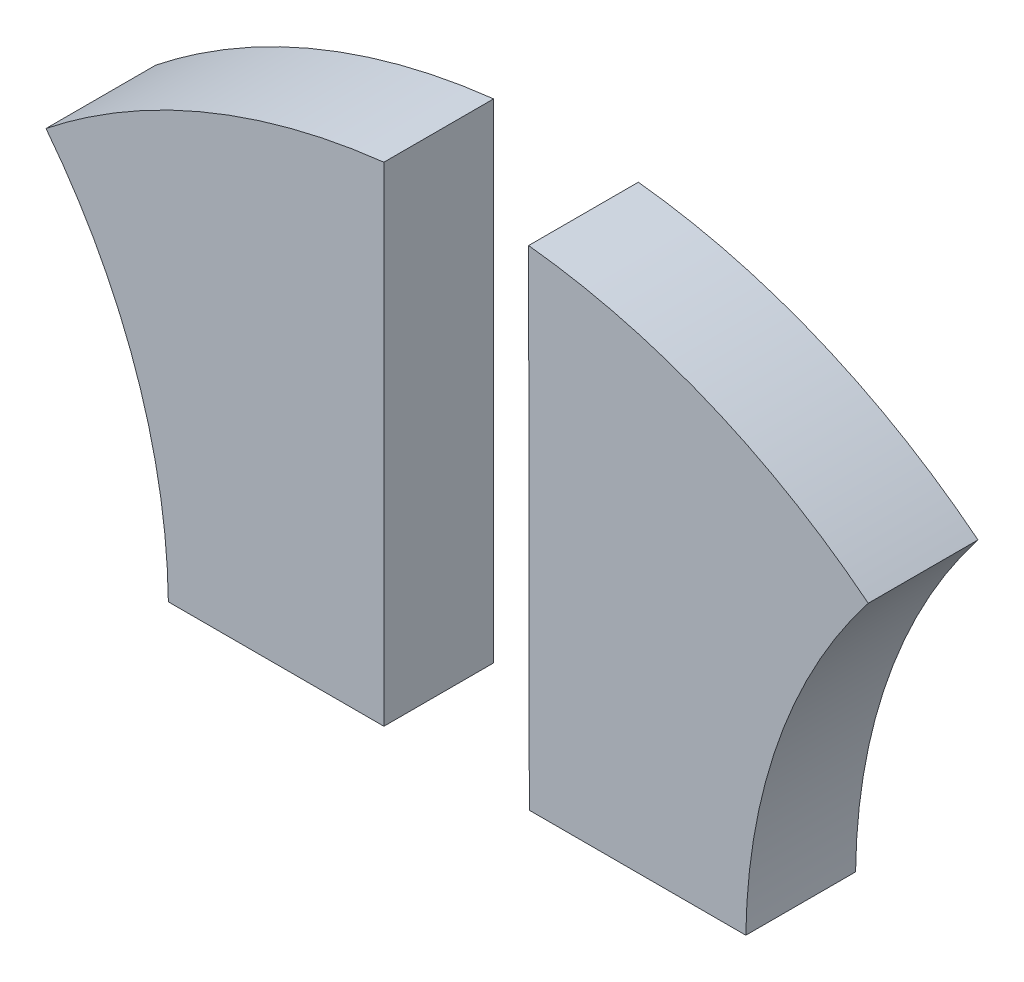
ISO-10303-21;
HEADER;
FILE_DESCRIPTION(('STEP AP214'),'2;1');
FILE_NAME('part.step','',(''),(''),'','','');
FILE_SCHEMA(('AUTOMOTIVE_DESIGN { 1 0 10303 214 1 1 1 1 }'));
ENDSEC;
DATA;
#1=APPLICATION_CONTEXT('core data for automotive mechanical design processes');
#2=APPLICATION_PROTOCOL_DEFINITION('international standard','automotive_design',2000,#1);
#3=PRODUCT_CONTEXT('',#1,'mechanical');
#4=PRODUCT('Part','Part','',(#3));
#5=PRODUCT_RELATED_PRODUCT_CATEGORY('part','',(#4));
#6=PRODUCT_DEFINITION_FORMATION('','',#4);
#7=PRODUCT_DEFINITION_CONTEXT('part definition',#1,'design');
#8=PRODUCT_DEFINITION('design','',#6,#7);
#9=PRODUCT_DEFINITION_SHAPE('','',#8);
#10=(LENGTH_UNIT() NAMED_UNIT(*) SI_UNIT(.MILLI.,.METRE.));
#11=(NAMED_UNIT(*) PLANE_ANGLE_UNIT() SI_UNIT($,.RADIAN.));
#12=(NAMED_UNIT(*) SI_UNIT($,.STERADIAN.) SOLID_ANGLE_UNIT());
#13=UNCERTAINTY_MEASURE_WITH_UNIT(LENGTH_MEASURE(1.E-05),#10,'distance_accuracy_value','');
#14=(GEOMETRIC_REPRESENTATION_CONTEXT(3) GLOBAL_UNCERTAINTY_ASSIGNED_CONTEXT((#13)) GLOBAL_UNIT_ASSIGNED_CONTEXT((#10,
#11,#12)) REPRESENTATION_CONTEXT('',''));
#15=CARTESIAN_POINT('',(0.,0.,0.));
#16=DIRECTION('',(0.,0.,1.));
#17=DIRECTION('',(1.,0.,0.));
#18=AXIS2_PLACEMENT_3D('',#15,#16,#17);
#19=CARTESIAN_POINT('',(60.095572165397,10.8267054054504,3.));
#20=DIRECTION('',(0.,0.,-1.));
#21=DIRECTION('',(-1.,0.,0.));
#22=AXIS2_PLACEMENT_3D('',#19,#20,#21);
#23=CYLINDRICAL_SURFACE('',#22,15.8034172145171);
#24=CARTESIAN_POINT('',(60.095572165397,10.8267054054504,0.));
#25=DIRECTION('',(0.,0.,1.));
#26=DIRECTION('',(1.,0.,0.));
#27=AXIS2_PLACEMENT_3D('',#24,#25,#26);
#28=CIRCLE('',#27,15.8034172145171);
#29=CARTESIAN_POINT('',(47.6408315030875,20.5543685724556,0.));
#30=VERTEX_POINT('',#29);
#31=CARTESIAN_POINT('',(44.2933266596376,11.0191440497028,0.));
#32=VERTEX_POINT('',#31);
#33=EDGE_CURVE('E106',#30,#32,#28,.T.);
#34=ORIENTED_EDGE('',*,*,#33,.F.);
#35=DIRECTION('',(0.,0.,-1.));
#36=VECTOR('',#35,1.);
#37=CARTESIAN_POINT('',(47.6408315030875,20.5543685724556,3.));
#38=LINE('',#37,#36);
#39=CARTESIAN_POINT('',(47.6408315030875,20.5543685724556,3.));
#40=VERTEX_POINT('',#39);
#41=EDGE_CURVE('E12',#40,#30,#38,.T.);
#42=ORIENTED_EDGE('',*,*,#41,.F.);
#43=CARTESIAN_POINT('',(60.095572165397,10.8267054054504,3.));
#44=DIRECTION('',(0.,0.,1.));
#45=DIRECTION('',(1.,0.,0.));
#46=AXIS2_PLACEMENT_3D('',#43,#44,#45);
#47=CIRCLE('',#46,15.8034172145171);
#48=CARTESIAN_POINT('',(44.2933266596376,11.0191440497028,3.));
#49=VERTEX_POINT('',#48);
#50=EDGE_CURVE('E90',#40,#49,#47,.T.);
#51=ORIENTED_EDGE('',*,*,#50,.T.);
#52=DIRECTION('',(0.,0.,-1.));
#53=VECTOR('',#52,1.);
#54=CARTESIAN_POINT('',(44.2933266596376,11.0191440497028,3.));
#55=LINE('',#54,#53);
#56=EDGE_CURVE('E58',#49,#32,#55,.T.);
#57=ORIENTED_EDGE('',*,*,#56,.T.);
#58=EDGE_LOOP('',(#34,#42,#51,#57));
#59=FACE_BOUND('',#58,.T.);
#60=ADVANCED_FACE('F42',(#59),#23,.F.);
#61=CARTESIAN_POINT('',(36.3995933997692,6.0191440497028,3.));
#62=DIRECTION('',(0.,0.,1.));
#63=DIRECTION('',(0.,-1.,0.));
#64=AXIS2_PLACEMENT_3D('',#61,#62,#63);
#65=ELLIPSE('',#64,18.4682577482241,18.2220143115811);
#66=DIRECTION('',(0.,0.,-1.));
#67=VECTOR('',#66,1.);
#68=SURFACE_OF_LINEAR_EXTRUSION('',#65,#67);
#69=CARTESIAN_POINT('',(36.3995933997692,6.0191440497028,0.));
#70=DIRECTION('',(0.,0.,1.));
#71=DIRECTION('',(0.,-1.,0.));
#72=AXIS2_PLACEMENT_3D('',#69,#70,#71);
#73=ELLIPSE('',#72,18.4682577482241,18.2220143115811);
#74=CARTESIAN_POINT('',(38.3541101703387,24.3808559502972,0.));
#75=VERTEX_POINT('',#74);
#76=EDGE_CURVE('E96',#30,#75,#73,.T.);
#77=ORIENTED_EDGE('',*,*,#76,.T.);
#78=DIRECTION('',(0.,0.,-1.));
#79=VECTOR('',#78,1.);
#80=CARTESIAN_POINT('',(38.3541101703387,24.3808559502972,3.));
#81=LINE('',#80,#79);
#82=CARTESIAN_POINT('',(38.3541101703387,24.3808559502972,3.));
#83=VERTEX_POINT('',#82);
#84=EDGE_CURVE('E50',#83,#75,#81,.T.);
#85=ORIENTED_EDGE('',*,*,#84,.F.);
#86=EDGE_CURVE('E84',#40,#83,#65,.T.);
#87=ORIENTED_EDGE('',*,*,#86,.F.);
#88=ORIENTED_EDGE('',*,*,#41,.T.);
#89=EDGE_LOOP('',(#77,#85,#87,#88));
#90=FACE_BOUND('',#89,.T.);
#91=ADVANCED_FACE('F94',(#90),#68,.F.);
#92=CARTESIAN_POINT('',(38.3883682565802,0.0540602241746898,3.));
#93=DIRECTION('',(-0.999999008424612,-0.00140824351294576,0.));
#94=DIRECTION('',(0.00140824351294576,-0.999999008424613,0.));
#95=AXIS2_PLACEMENT_3D('',#92,#93,#94);
#96=PLANE('',#95);
#97=DIRECTION('',(-0.00140824351294576,0.999999008424613,0.));
#98=VECTOR('',#97,1.);
#99=CARTESIAN_POINT('',(38.3883682565802,0.0540602241746898,0.));
#100=LINE('',#99,#98);
#101=CARTESIAN_POINT('',(38.3729267331026,11.0191440497028,0.));
#102=VERTEX_POINT('',#101);
#103=EDGE_CURVE('E109',#102,#75,#100,.T.);
#104=ORIENTED_EDGE('',*,*,#103,.F.);
#105=DIRECTION('',(0.,0.,-1.));
#106=VECTOR('',#105,1.);
#107=CARTESIAN_POINT('',(38.3729267331026,11.0191440497028,3.));
#108=LINE('',#107,#106);
#109=CARTESIAN_POINT('',(38.3729267331026,11.0191440497028,3.));
#110=VERTEX_POINT('',#109);
#111=EDGE_CURVE('E71',#110,#102,#108,.T.);
#112=ORIENTED_EDGE('',*,*,#111,.F.);
#113=DIRECTION('',(-0.00140824351294576,0.999999008424613,0.));
#114=VECTOR('',#113,1.);
#115=CARTESIAN_POINT('',(38.3883682565802,0.0540602241746898,3.));
#116=LINE('',#115,#114);
#117=EDGE_CURVE('E89',#110,#83,#116,.T.);
#118=ORIENTED_EDGE('',*,*,#117,.T.);
#119=ORIENTED_EDGE('',*,*,#84,.T.);
#120=EDGE_LOOP('',(#104,#112,#118,#119));
#121=FACE_BOUND('',#120,.T.);
#122=ADVANCED_FACE('F99',(#121),#96,.T.);
#123=CARTESIAN_POINT('',(0.,11.0191440497028,3.));
#124=DIRECTION('',(0.,-1.,0.));
#125=DIRECTION('',(0.,0.,-1.));
#126=AXIS2_PLACEMENT_3D('',#123,#124,#125);
#127=PLANE('',#126);
#128=DIRECTION('',(-1.,0.,0.));
#129=VECTOR('',#128,1.);
#130=CARTESIAN_POINT('',(0.,11.0191440497028,0.));
#131=LINE('',#130,#129);
#132=EDGE_CURVE('E111',#32,#102,#131,.T.);
#133=ORIENTED_EDGE('',*,*,#132,.F.);
#134=ORIENTED_EDGE('',*,*,#56,.F.);
#135=DIRECTION('',(-1.,0.,0.));
#136=VECTOR('',#135,1.);
#137=CARTESIAN_POINT('',(0.,11.0191440497028,3.));
#138=LINE('',#137,#136);
#139=EDGE_CURVE('E100',#49,#110,#138,.T.);
#140=ORIENTED_EDGE('',*,*,#139,.T.);
#141=ORIENTED_EDGE('',*,*,#111,.T.);
#142=EDGE_LOOP('',(#133,#134,#140,#141));
#143=FACE_BOUND('',#142,.T.);
#144=ADVANCED_FACE('F116',(#143),#127,.T.);
#145=CARTESIAN_POINT('',(0.,0.,3.));
#146=DIRECTION('',(0.,0.,1.));
#147=DIRECTION('',(1.,0.,0.));
#148=AXIS2_PLACEMENT_3D('',#145,#146,#147);
#149=PLANE('',#148);
#150=ORIENTED_EDGE('',*,*,#50,.F.);
#151=ORIENTED_EDGE('',*,*,#86,.T.);
#152=ORIENTED_EDGE('',*,*,#117,.F.);
#153=ORIENTED_EDGE('',*,*,#139,.F.);
#154=EDGE_LOOP('',(#150,#151,#152,#153));
#155=FACE_BOUND('',#154,.T.);
#156=ADVANCED_FACE('F86',(#155),#149,.T.);
#157=CARTESIAN_POINT('',(0.,0.,0.));
#158=DIRECTION('',(0.,0.,1.));
#159=DIRECTION('',(1.,0.,0.));
#160=AXIS2_PLACEMENT_3D('',#157,#158,#159);
#161=PLANE('',#160);
#162=ORIENTED_EDGE('',*,*,#33,.T.);
#163=ORIENTED_EDGE('',*,*,#132,.T.);
#164=ORIENTED_EDGE('',*,*,#103,.T.);
#165=ORIENTED_EDGE('',*,*,#76,.F.);
#166=EDGE_LOOP('',(#162,#163,#164,#165));
#167=FACE_BOUND('',#166,.T.);
#168=ADVANCED_FACE('F123',(#167),#161,.F.);
#169=CLOSED_SHELL('',(#60,#91,#122,#144,#156,#168));
#170=MANIFOLD_SOLID_BREP('B2',#169);
#171=CARTESIAN_POINT('',(34.3971498053675,3.75268725076385E-13,3.));
#172=DIRECTION('',(1.,0.,0.));
#173=DIRECTION('',(0.,1.,0.));
#174=AXIS2_PLACEMENT_3D('',#171,#172,#173);
#175=PLANE('',#174);
#176=DIRECTION('',(0.,-1.,0.));
#177=VECTOR('',#176,1.);
#178=CARTESIAN_POINT('',(34.3971498053675,3.75268725076385E-13,0.));
#179=LINE('',#178,#177);
#180=CARTESIAN_POINT('',(34.3971498053672,24.3755505394815,0.));
#181=VERTEX_POINT('',#180);
#182=CARTESIAN_POINT('',(34.3971498053673,11.0191440497028,0.));
#183=VERTEX_POINT('',#182);
#184=EDGE_CURVE('E230',#181,#183,#179,.T.);
#185=ORIENTED_EDGE('',*,*,#184,.F.);
#186=DIRECTION('',(0.,0.,-1.));
#187=VECTOR('',#186,1.);
#188=CARTESIAN_POINT('',(34.3971498053672,24.3755505394815,3.));
#189=LINE('',#188,#187);
#190=CARTESIAN_POINT('',(34.3971498053672,24.3755505394815,3.));
#191=VERTEX_POINT('',#190);
#192=EDGE_CURVE('E40',#191,#181,#189,.T.);
#193=ORIENTED_EDGE('',*,*,#192,.F.);
#194=DIRECTION('',(0.,-1.,0.));
#195=VECTOR('',#194,1.);
#196=CARTESIAN_POINT('',(34.3971498053675,3.75268725076385E-13,3.));
#197=LINE('',#196,#195);
#198=CARTESIAN_POINT('',(34.3971498053673,11.0191440497028,3.));
#199=VERTEX_POINT('',#198);
#200=EDGE_CURVE('E214',#191,#199,#197,.T.);
#201=ORIENTED_EDGE('',*,*,#200,.T.);
#202=DIRECTION('',(0.,0.,-1.));
#203=VECTOR('',#202,1.);
#204=CARTESIAN_POINT('',(34.3971498053673,11.0191440497028,3.));
#205=LINE('',#204,#203);
#206=EDGE_CURVE('E182',#199,#183,#205,.T.);
#207=ORIENTED_EDGE('',*,*,#206,.T.);
#208=EDGE_LOOP('',(#185,#193,#201,#207));
#209=FACE_BOUND('',#208,.T.);
#210=ADVANCED_FACE('F166',(#209),#175,.T.);
#211=CARTESIAN_POINT('',(36.3995933997692,6.0191440497028,3.));
#212=DIRECTION('',(0.,0.,1.));
#213=DIRECTION('',(0.,-1.,0.));
#214=AXIS2_PLACEMENT_3D('',#211,#212,#213);
#215=ELLIPSE('',#214,18.4682577482241,18.2220143115811);
#216=DIRECTION('',(0.,0.,-1.));
#217=VECTOR('',#216,1.);
#218=SURFACE_OF_LINEAR_EXTRUSION('',#215,#217);
#219=CARTESIAN_POINT('',(36.3995933997692,6.0191440497028,0.));
#220=DIRECTION('',(0.,0.,1.));
#221=DIRECTION('',(0.,-1.,0.));
#222=AXIS2_PLACEMENT_3D('',#219,#220,#221);
#223=ELLIPSE('',#222,18.4682577482241,18.2220143115811);
#224=CARTESIAN_POINT('',(25.1591192696857,20.5549754566283,0.));
#225=VERTEX_POINT('',#224);
#226=EDGE_CURVE('E220',#181,#225,#223,.T.);
#227=ORIENTED_EDGE('',*,*,#226,.T.);
#228=DIRECTION('',(0.,0.,-1.));
#229=VECTOR('',#228,1.);
#230=CARTESIAN_POINT('',(25.1591192696857,20.5549754566283,3.));
#231=LINE('',#230,#229);
#232=CARTESIAN_POINT('',(25.1591192696857,20.5549754566283,3.));
#233=VERTEX_POINT('',#232);
#234=EDGE_CURVE('E174',#233,#225,#231,.T.);
#235=ORIENTED_EDGE('',*,*,#234,.F.);
#236=EDGE_CURVE('E208',#191,#233,#215,.T.);
#237=ORIENTED_EDGE('',*,*,#236,.F.);
#238=ORIENTED_EDGE('',*,*,#192,.T.);
#239=EDGE_LOOP('',(#227,#235,#237,#238));
#240=FACE_BOUND('',#239,.T.);
#241=ADVANCED_FACE('F218',(#240),#218,.F.);
#242=CARTESIAN_POINT('',(12.6954759511937,10.8273128014198,3.));
#243=DIRECTION('',(0.,0.,-1.));
#244=DIRECTION('',(-1.,0.,0.));
#245=AXIS2_PLACEMENT_3D('',#242,#243,#244);
#246=CYLINDRICAL_SURFACE('',#245,15.8104340707056);
#247=CARTESIAN_POINT('',(12.6954759511937,10.8273128014198,0.));
#248=DIRECTION('',(0.,0.,1.));
#249=DIRECTION('',(1.,0.,0.));
#250=AXIS2_PLACEMENT_3D('',#247,#248,#249);
#251=CIRCLE('',#250,15.8104340707056);
#252=CARTESIAN_POINT('',(28.5047462150709,11.0191440497028,0.));
#253=VERTEX_POINT('',#252);
#254=EDGE_CURVE('E233',#253,#225,#251,.T.);
#255=ORIENTED_EDGE('',*,*,#254,.F.);
#256=DIRECTION('',(0.,0.,-1.));
#257=VECTOR('',#256,1.);
#258=CARTESIAN_POINT('',(28.5047462150709,11.0191440497028,3.));
#259=LINE('',#258,#257);
#260=CARTESIAN_POINT('',(28.5047462150709,11.0191440497028,3.));
#261=VERTEX_POINT('',#260);
#262=EDGE_CURVE('E195',#261,#253,#259,.T.);
#263=ORIENTED_EDGE('',*,*,#262,.F.);
#264=CARTESIAN_POINT('',(12.6954759511937,10.8273128014198,3.));
#265=DIRECTION('',(0.,0.,1.));
#266=DIRECTION('',(1.,0.,0.));
#267=AXIS2_PLACEMENT_3D('',#264,#265,#266);
#268=CIRCLE('',#267,15.8104340707056);
#269=EDGE_CURVE('E213',#261,#233,#268,.T.);
#270=ORIENTED_EDGE('',*,*,#269,.T.);
#271=ORIENTED_EDGE('',*,*,#234,.T.);
#272=EDGE_LOOP('',(#255,#263,#270,#271));
#273=FACE_BOUND('',#272,.T.);
#274=ADVANCED_FACE('F223',(#273),#246,.F.);
#275=CARTESIAN_POINT('',(0.,11.0191440497028,3.));
#276=DIRECTION('',(0.,-1.,0.));
#277=DIRECTION('',(0.,0.,-1.));
#278=AXIS2_PLACEMENT_3D('',#275,#276,#277);
#279=PLANE('',#278);
#280=DIRECTION('',(-1.,0.,0.));
#281=VECTOR('',#280,1.);
#282=CARTESIAN_POINT('',(0.,11.0191440497028,0.));
#283=LINE('',#282,#281);
#284=EDGE_CURVE('E235',#183,#253,#283,.T.);
#285=ORIENTED_EDGE('',*,*,#284,.F.);
#286=ORIENTED_EDGE('',*,*,#206,.F.);
#287=DIRECTION('',(-1.,0.,0.));
#288=VECTOR('',#287,1.);
#289=CARTESIAN_POINT('',(0.,11.0191440497028,3.));
#290=LINE('',#289,#288);
#291=EDGE_CURVE('E224',#199,#261,#290,.T.);
#292=ORIENTED_EDGE('',*,*,#291,.T.);
#293=ORIENTED_EDGE('',*,*,#262,.T.);
#294=EDGE_LOOP('',(#285,#286,#292,#293));
#295=FACE_BOUND('',#294,.T.);
#296=ADVANCED_FACE('F240',(#295),#279,.T.);
#297=CARTESIAN_POINT('',(0.,0.,3.));
#298=DIRECTION('',(0.,0.,1.));
#299=DIRECTION('',(1.,0.,0.));
#300=AXIS2_PLACEMENT_3D('',#297,#298,#299);
#301=PLANE('',#300);
#302=ORIENTED_EDGE('',*,*,#200,.F.);
#303=ORIENTED_EDGE('',*,*,#236,.T.);
#304=ORIENTED_EDGE('',*,*,#269,.F.);
#305=ORIENTED_EDGE('',*,*,#291,.F.);
#306=EDGE_LOOP('',(#302,#303,#304,#305));
#307=FACE_BOUND('',#306,.T.);
#308=ADVANCED_FACE('F210',(#307),#301,.T.);
#309=CARTESIAN_POINT('',(0.,0.,0.));
#310=DIRECTION('',(0.,0.,1.));
#311=DIRECTION('',(1.,0.,0.));
#312=AXIS2_PLACEMENT_3D('',#309,#310,#311);
#313=PLANE('',#312);
#314=ORIENTED_EDGE('',*,*,#184,.T.);
#315=ORIENTED_EDGE('',*,*,#284,.T.);
#316=ORIENTED_EDGE('',*,*,#254,.T.);
#317=ORIENTED_EDGE('',*,*,#226,.F.);
#318=EDGE_LOOP('',(#314,#315,#316,#317));
#319=FACE_BOUND('',#318,.T.);
#320=ADVANCED_FACE('F247',(#319),#313,.F.);
#321=CLOSED_SHELL('',(#210,#241,#274,#296,#308,#320));
#322=MANIFOLD_SOLID_BREP('B6',#321);
#323=ADVANCED_BREP_SHAPE_REPRESENTATION('',(#18,#170,#322),#14);
#324=SHAPE_DEFINITION_REPRESENTATION(#9,#323);
ENDSEC;
END-ISO-10303-21;
